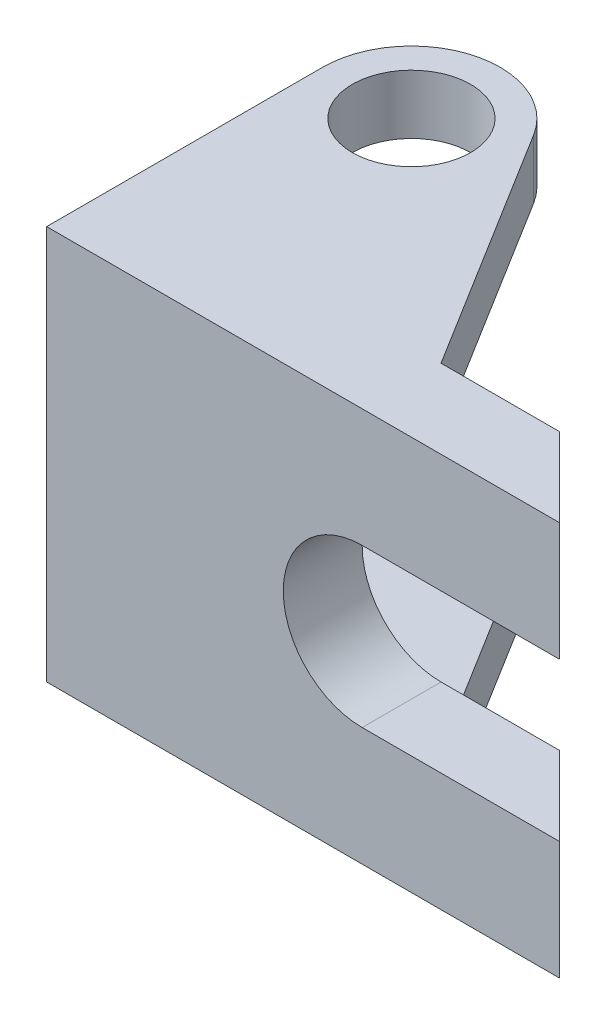
ISO-10303-21;
HEADER;
FILE_DESCRIPTION(('STEP AP214'),'2;1');
FILE_NAME('part.step','',(''),(''),'','','');
FILE_SCHEMA(('AUTOMOTIVE_DESIGN { 1 0 10303 214 1 1 1 1 }'));
ENDSEC;
DATA;
#1=APPLICATION_CONTEXT('core data for automotive mechanical design processes');
#2=APPLICATION_PROTOCOL_DEFINITION('international standard','automotive_design',2000,#1);
#3=PRODUCT_CONTEXT('',#1,'mechanical');
#4=PRODUCT('Part','Part','',(#3));
#5=PRODUCT_RELATED_PRODUCT_CATEGORY('part','',(#4));
#6=PRODUCT_DEFINITION_FORMATION('','',#4);
#7=PRODUCT_DEFINITION_CONTEXT('part definition',#1,'design');
#8=PRODUCT_DEFINITION('design','',#6,#7);
#9=PRODUCT_DEFINITION_SHAPE('','',#8);
#10=(LENGTH_UNIT() NAMED_UNIT(*) SI_UNIT(.MILLI.,.METRE.));
#11=(NAMED_UNIT(*) PLANE_ANGLE_UNIT() SI_UNIT($,.RADIAN.));
#12=(NAMED_UNIT(*) SI_UNIT($,.STERADIAN.) SOLID_ANGLE_UNIT());
#13=UNCERTAINTY_MEASURE_WITH_UNIT(LENGTH_MEASURE(1.E-05),#10,'distance_accuracy_value','');
#14=(GEOMETRIC_REPRESENTATION_CONTEXT(3) GLOBAL_UNCERTAINTY_ASSIGNED_CONTEXT((#13)) GLOBAL_UNIT_ASSIGNED_CONTEXT((#10,
#11,#12)) REPRESENTATION_CONTEXT('',''));
#15=CARTESIAN_POINT('',(0.,0.,0.));
#16=DIRECTION('',(0.,0.,1.));
#17=DIRECTION('',(1.,0.,0.));
#18=AXIS2_PLACEMENT_3D('',#15,#16,#17);
#19=CARTESIAN_POINT('',(0.,100.,35.));
#20=DIRECTION('',(0.,0.,1.));
#21=DIRECTION('',(1.,0.,0.));
#22=AXIS2_PLACEMENT_3D('',#19,#20,#21);
#23=PLANE('',#22);
#24=CARTESIAN_POINT('',(15.,50.,35.));
#25=DIRECTION('',(0.,0.,-1.));
#26=DIRECTION('',(-1.,0.,0.));
#27=AXIS2_PLACEMENT_3D('',#24,#25,#26);
#28=CIRCLE('',#27,20.);
#29=CARTESIAN_POINT('',(15.,30.,35.));
#30=VERTEX_POINT('',#29);
#31=CARTESIAN_POINT('',(15.,70.,35.));
#32=VERTEX_POINT('',#31);
#33=EDGE_CURVE('E203',#30,#32,#28,.T.);
#34=ORIENTED_EDGE('',*,*,#33,.T.);
#35=DIRECTION('',(-1.,0.,0.));
#36=VECTOR('',#35,1.);
#37=CARTESIAN_POINT('',(0.,70.,35.));
#38=LINE('',#37,#36);
#39=CARTESIAN_POINT('',(65.,70.,35.));
#40=VERTEX_POINT('',#39);
#41=EDGE_CURVE('E217',#40,#32,#38,.T.);
#42=ORIENTED_EDGE('',*,*,#41,.F.);
#43=DIRECTION('',(0.,-1.,0.));
#44=VECTOR('',#43,1.);
#45=CARTESIAN_POINT('',(65.,100.,35.));
#46=LINE('',#45,#44);
#47=CARTESIAN_POINT('',(65.,100.,35.));
#48=VERTEX_POINT('',#47);
#49=EDGE_CURVE('E338',#48,#40,#46,.T.);
#50=ORIENTED_EDGE('',*,*,#49,.F.);
#51=DIRECTION('',(-1.,0.,0.));
#52=VECTOR('',#51,1.);
#53=CARTESIAN_POINT('',(0.,100.,35.));
#54=LINE('',#53,#52);
#55=CARTESIAN_POINT('',(-65.,100.,35.));
#56=VERTEX_POINT('',#55);
#57=EDGE_CURVE('E279',#48,#56,#54,.T.);
#58=ORIENTED_EDGE('',*,*,#57,.T.);
#59=DIRECTION('',(0.,-1.,0.));
#60=VECTOR('',#59,1.);
#61=CARTESIAN_POINT('',(-65.,100.,35.));
#62=LINE('',#61,#60);
#63=CARTESIAN_POINT('',(-65.,0.,35.));
#64=VERTEX_POINT('',#63);
#65=EDGE_CURVE('E342',#56,#64,#62,.T.);
#66=ORIENTED_EDGE('',*,*,#65,.T.);
#67=DIRECTION('',(-1.,0.,0.));
#68=VECTOR('',#67,1.);
#69=CARTESIAN_POINT('',(0.,0.,35.));
#70=LINE('',#69,#68);
#71=CARTESIAN_POINT('',(65.,0.,35.));
#72=VERTEX_POINT('',#71);
#73=EDGE_CURVE('E305',#72,#64,#70,.T.);
#74=ORIENTED_EDGE('',*,*,#73,.F.);
#75=CARTESIAN_POINT('',(65.,30.,35.));
#76=VERTEX_POINT('',#75);
#77=EDGE_CURVE('E215',#76,#72,#46,.T.);
#78=ORIENTED_EDGE('',*,*,#77,.F.);
#79=DIRECTION('',(-1.,0.,0.));
#80=VECTOR('',#79,1.);
#81=CARTESIAN_POINT('',(0.,30.,35.));
#82=LINE('',#81,#80);
#83=EDGE_CURVE('E197',#76,#30,#82,.T.);
#84=ORIENTED_EDGE('',*,*,#83,.T.);
#85=EDGE_LOOP('',(#34,#42,#50,#58,#66,#74,#78,#84));
#86=FACE_BOUND('',#85,.T.);
#87=ADVANCED_FACE('F93',(#86),#23,.T.);
#88=CARTESIAN_POINT('',(15.,100.,-15.));
#89=DIRECTION('',(-0.707106781186547,0.,0.707106781186548));
#90=DIRECTION('',(0.707106781186548,0.,0.707106781186547));
#91=AXIS2_PLACEMENT_3D('',#88,#89,#90);
#92=PLANE('',#91);
#93=DIRECTION('',(0.707106781186548,0.,0.707106781186547));
#94=VECTOR('',#93,1.);
#95=CARTESIAN_POINT('',(15.,70.,-15.));
#96=LINE('',#95,#94);
#97=CARTESIAN_POINT('',(45.,70.,15.));
#98=VERTEX_POINT('',#97);
#99=EDGE_CURVE('E231',#98,#40,#96,.T.);
#100=ORIENTED_EDGE('',*,*,#99,.F.);
#101=DIRECTION('',(0.,-1.,0.));
#102=VECTOR('',#101,1.);
#103=CARTESIAN_POINT('',(45.,100.,15.));
#104=LINE('',#103,#102);
#105=CARTESIAN_POINT('',(45.,100.,15.));
#106=VERTEX_POINT('',#105);
#107=EDGE_CURVE('E334',#106,#98,#104,.T.);
#108=ORIENTED_EDGE('',*,*,#107,.F.);
#109=DIRECTION('',(-0.707106781186548,0.,-0.707106781186547));
#110=VECTOR('',#109,1.);
#111=CARTESIAN_POINT('',(15.,100.,-15.));
#112=LINE('',#111,#110);
#113=EDGE_CURVE('E283',#48,#106,#112,.T.);
#114=ORIENTED_EDGE('',*,*,#113,.F.);
#115=ORIENTED_EDGE('',*,*,#49,.T.);
#116=EDGE_LOOP('',(#100,#108,#114,#115));
#117=FACE_BOUND('',#116,.T.);
#118=ADVANCED_FACE('F399',(#117),#92,.F.);
#119=CARTESIAN_POINT('',(0.,100.,15.));
#120=DIRECTION('',(0.,0.,1.));
#121=DIRECTION('',(1.,0.,0.));
#122=AXIS2_PLACEMENT_3D('',#119,#120,#121);
#123=PLANE('',#122);
#124=DIRECTION('',(1.,0.,0.));
#125=VECTOR('',#124,1.);
#126=CARTESIAN_POINT('',(0.,70.,15.));
#127=LINE('',#126,#125);
#128=CARTESIAN_POINT('',(15.,70.,15.));
#129=VERTEX_POINT('',#128);
#130=EDGE_CURVE('E228',#129,#98,#127,.T.);
#131=ORIENTED_EDGE('',*,*,#130,.F.);
#132=CARTESIAN_POINT('',(15.,50.,15.));
#133=DIRECTION('',(0.,0.,-1.));
#134=DIRECTION('',(-1.,0.,0.));
#135=AXIS2_PLACEMENT_3D('',#132,#133,#134);
#136=CIRCLE('',#135,20.);
#137=CARTESIAN_POINT('',(15.,30.,15.));
#138=VERTEX_POINT('',#137);
#139=EDGE_CURVE('E236',#138,#129,#136,.T.);
#140=ORIENTED_EDGE('',*,*,#139,.F.);
#141=DIRECTION('',(1.,0.,0.));
#142=VECTOR('',#141,1.);
#143=CARTESIAN_POINT('',(0.,30.,15.));
#144=LINE('',#143,#142);
#145=CARTESIAN_POINT('',(45.,30.,15.));
#146=VERTEX_POINT('',#145);
#147=EDGE_CURVE('E198',#138,#146,#144,.T.);
#148=ORIENTED_EDGE('',*,*,#147,.T.);
#149=CARTESIAN_POINT('',(45.,0.,15.));
#150=VERTEX_POINT('',#149);
#151=EDGE_CURVE('E333',#146,#150,#104,.T.);
#152=ORIENTED_EDGE('',*,*,#151,.T.);
#153=DIRECTION('',(-1.,0.,0.));
#154=VECTOR('',#153,1.);
#155=CARTESIAN_POINT('',(0.,0.,15.));
#156=LINE('',#155,#154);
#157=CARTESIAN_POINT('',(15.,0.,15.));
#158=VERTEX_POINT('',#157);
#159=EDGE_CURVE('E313',#150,#158,#156,.T.);
#160=ORIENTED_EDGE('',*,*,#159,.T.);
#161=DIRECTION('',(0.,-1.,0.));
#162=VECTOR('',#161,1.);
#163=CARTESIAN_POINT('',(15.,100.,15.));
#164=LINE('',#163,#162);
#165=CARTESIAN_POINT('',(15.,15.,15.));
#166=VERTEX_POINT('',#165);
#167=EDGE_CURVE('E328',#166,#158,#164,.T.);
#168=ORIENTED_EDGE('',*,*,#167,.F.);
#169=DIRECTION('',(-1.,0.,0.));
#170=VECTOR('',#169,1.);
#171=CARTESIAN_POINT('',(0.,15.,15.));
#172=LINE('',#171,#170);
#173=CARTESIAN_POINT('',(-65.,15.,15.));
#174=VERTEX_POINT('',#173);
#175=EDGE_CURVE('E239',#166,#174,#172,.T.);
#176=ORIENTED_EDGE('',*,*,#175,.T.);
#177=DIRECTION('',(0.,-1.,0.));
#178=VECTOR('',#177,1.);
#179=CARTESIAN_POINT('',(-65.,100.,15.));
#180=LINE('',#179,#178);
#181=CARTESIAN_POINT('',(-65.,85.,15.));
#182=VERTEX_POINT('',#181);
#183=EDGE_CURVE('E243',#182,#174,#180,.T.);
#184=ORIENTED_EDGE('',*,*,#183,.F.);
#185=DIRECTION('',(-1.,0.,0.));
#186=VECTOR('',#185,1.);
#187=CARTESIAN_POINT('',(0.,85.,15.));
#188=LINE('',#187,#186);
#189=CARTESIAN_POINT('',(15.,85.,15.));
#190=VERTEX_POINT('',#189);
#191=EDGE_CURVE('E117',#190,#182,#188,.T.);
#192=ORIENTED_EDGE('',*,*,#191,.F.);
#193=CARTESIAN_POINT('',(15.,100.,15.));
#194=VERTEX_POINT('',#193);
#195=EDGE_CURVE('E329',#194,#190,#164,.T.);
#196=ORIENTED_EDGE('',*,*,#195,.F.);
#197=DIRECTION('',(-1.,0.,0.));
#198=VECTOR('',#197,1.);
#199=CARTESIAN_POINT('',(0.,100.,15.));
#200=LINE('',#199,#198);
#201=EDGE_CURVE('E286',#106,#194,#200,.T.);
#202=ORIENTED_EDGE('',*,*,#201,.F.);
#203=ORIENTED_EDGE('',*,*,#107,.T.);
#204=EDGE_LOOP('',(#131,#140,#148,#152,#160,#168,#176,#184,#192,#196,#202,#203));
#205=FACE_BOUND('',#204,.T.);
#206=ADVANCED_FACE('F359',(#205),#123,.F.);
#207=CARTESIAN_POINT('',(-42.5,100.,-35.));
#208=DIRECTION('',(0.,-1.,0.));
#209=DIRECTION('',(0.,0.,-1.));
#210=AXIS2_PLACEMENT_3D('',#207,#208,#209);
#211=CYLINDRICAL_SURFACE('',#210,15.);
#212=CARTESIAN_POINT('',(-42.5,0.,-35.));
#213=DIRECTION('',(0.,1.,0.));
#214=DIRECTION('',(0.,0.,1.));
#215=AXIS2_PLACEMENT_3D('',#212,#213,#214);
#216=CIRCLE('',#215,15.);
#217=CARTESIAN_POINT('',(-42.5,0.,-20.));
#218=VERTEX_POINT('',#217);
#219=EDGE_CURVE('E275',#218,#218,#216,.T.);
#220=ORIENTED_EDGE('',*,*,#219,.F.);
#221=EDGE_LOOP('',(#220));
#222=FACE_BOUND('',#221,.T.);
#223=CARTESIAN_POINT('',(-42.5,15.,-35.));
#224=DIRECTION('',(0.,1.,0.));
#225=DIRECTION('',(0.,0.,1.));
#226=AXIS2_PLACEMENT_3D('',#223,#224,#225);
#227=CIRCLE('',#226,15.);
#228=CARTESIAN_POINT('',(-42.5,15.,-20.));
#229=VERTEX_POINT('',#228);
#230=EDGE_CURVE('E254',#229,#229,#227,.T.);
#231=ORIENTED_EDGE('',*,*,#230,.T.);
#232=EDGE_LOOP('',(#231));
#233=FACE_BOUND('',#232,.T.);
#234=ADVANCED_FACE('F429',(#222,#233),#211,.F.);
#235=CARTESIAN_POINT('',(-42.5,100.,-35.));
#236=DIRECTION('',(0.,-1.,0.));
#237=DIRECTION('',(0.,0.,-1.));
#238=AXIS2_PLACEMENT_3D('',#235,#236,#237);
#239=CYLINDRICAL_SURFACE('',#238,22.5);
#240=CARTESIAN_POINT('',(-42.5,15.,-35.));
#241=DIRECTION('',(0.,1.,0.));
#242=DIRECTION('',(0.,0.,1.));
#243=AXIS2_PLACEMENT_3D('',#240,#241,#242);
#244=CIRCLE('',#243,22.5);
#245=CARTESIAN_POINT('',(-23.3808419798655,15.,-46.8620317231547));
#246=VERTEX_POINT('',#245);
#247=CARTESIAN_POINT('',(-65.,15.,-35.));
#248=VERTEX_POINT('',#247);
#249=EDGE_CURVE('E247',#246,#248,#244,.T.);
#250=ORIENTED_EDGE('',*,*,#249,.F.);
#251=DIRECTION('',(0.,-1.,0.));
#252=VECTOR('',#251,1.);
#253=CARTESIAN_POINT('',(-23.3808419798655,100.,-46.8620317231547));
#254=LINE('',#253,#252);
#255=CARTESIAN_POINT('',(-23.3808419798655,0.,-46.8620317231547));
#256=VERTEX_POINT('',#255);
#257=EDGE_CURVE('E297',#246,#256,#254,.T.);
#258=ORIENTED_EDGE('',*,*,#257,.T.);
#259=CARTESIAN_POINT('',(-42.5,0.,-35.));
#260=DIRECTION('',(0.,1.,0.));
#261=DIRECTION('',(0.,0.,1.));
#262=AXIS2_PLACEMENT_3D('',#259,#260,#261);
#263=CIRCLE('',#262,22.5);
#264=CARTESIAN_POINT('',(-65.,0.,-35.));
#265=VERTEX_POINT('',#264);
#266=EDGE_CURVE('E269',#256,#265,#263,.T.);
#267=ORIENTED_EDGE('',*,*,#266,.T.);
#268=DIRECTION('',(0.,-1.,0.));
#269=VECTOR('',#268,1.);
#270=CARTESIAN_POINT('',(-65.,100.,-35.));
#271=LINE('',#270,#269);
#272=EDGE_CURVE('E345',#248,#265,#271,.T.);
#273=ORIENTED_EDGE('',*,*,#272,.F.);
#274=EDGE_LOOP('',(#250,#258,#267,#273));
#275=FACE_BOUND('',#274,.T.);
#276=ADVANCED_FACE('F366',(#275),#239,.T.);
#277=CARTESIAN_POINT('',(4.11111539093425,100.,-2.55064481048043));
#278=DIRECTION('',(0.849740356450421,0.,-0.527201409917984));
#279=DIRECTION('',(-0.527201409917984,0.,-0.849740356450421));
#280=AXIS2_PLACEMENT_3D('',#277,#278,#279);
#281=PLANE('',#280);
#282=DIRECTION('',(0.527201409917984,0.,0.849740356450421));
#283=VECTOR('',#282,1.);
#284=CARTESIAN_POINT('',(4.11111539093425,85.,-2.55064481048043));
#285=LINE('',#284,#283);
#286=CARTESIAN_POINT('',(-23.3808419798655,85.,-46.8620317231547));
#287=VERTEX_POINT('',#286);
#288=EDGE_CURVE('E12',#287,#190,#285,.T.);
#289=ORIENTED_EDGE('',*,*,#288,.F.);
#290=CARTESIAN_POINT('',(-23.3808419798655,100.,-46.8620317231547));
#291=VERTEX_POINT('',#290);
#292=EDGE_CURVE('E324',#291,#287,#254,.T.);
#293=ORIENTED_EDGE('',*,*,#292,.F.);
#294=DIRECTION('',(0.527201409917984,0.,0.849740356450421));
#295=VECTOR('',#294,1.);
#296=CARTESIAN_POINT('',(4.11111539093425,100.,-2.55064481048043));
#297=LINE('',#296,#295);
#298=EDGE_CURVE('E289',#291,#194,#297,.T.);
#299=ORIENTED_EDGE('',*,*,#298,.T.);
#300=ORIENTED_EDGE('',*,*,#195,.T.);
#301=EDGE_LOOP('',(#289,#293,#299,#300));
#302=FACE_BOUND('',#301,.T.);
#303=ADVANCED_FACE('F395',(#302),#281,.T.);
#304=ORIENTED_EDGE('',*,*,#257,.F.);
#305=DIRECTION('',(0.527201409917984,0.,0.849740356450421));
#306=VECTOR('',#305,1.);
#307=CARTESIAN_POINT('',(4.11111539093425,15.,-2.55064481048043));
#308=LINE('',#307,#306);
#309=EDGE_CURVE('E102',#246,#166,#308,.T.);
#310=ORIENTED_EDGE('',*,*,#309,.T.);
#311=ORIENTED_EDGE('',*,*,#167,.T.);
#312=DIRECTION('',(0.527201409917984,0.,0.849740356450421));
#313=VECTOR('',#312,1.);
#314=CARTESIAN_POINT('',(4.11111539093425,0.,-2.55064481048043));
#315=LINE('',#314,#313);
#316=EDGE_CURVE('E317',#256,#158,#315,.T.);
#317=ORIENTED_EDGE('',*,*,#316,.F.);
#318=EDGE_LOOP('',(#304,#310,#311,#317));
#319=FACE_BOUND('',#318,.T.);
#320=ADVANCED_FACE('F355',(#319),#281,.T.);
#321=CARTESIAN_POINT('',(-42.5,85.,-35.));
#322=DIRECTION('',(0.,1.,0.));
#323=DIRECTION('',(0.,0.,1.));
#324=AXIS2_PLACEMENT_3D('',#321,#322,#323);
#325=CIRCLE('',#324,15.);
#326=CARTESIAN_POINT('',(-42.5,85.,-20.));
#327=VERTEX_POINT('',#326);
#328=EDGE_CURVE('E265',#327,#327,#325,.T.);
#329=ORIENTED_EDGE('',*,*,#328,.F.);
#330=EDGE_LOOP('',(#329));
#331=FACE_BOUND('',#330,.T.);
#332=CARTESIAN_POINT('',(-42.5,100.,-35.));
#333=DIRECTION('',(0.,1.,0.));
#334=DIRECTION('',(0.,0.,1.));
#335=AXIS2_PLACEMENT_3D('',#332,#333,#334);
#336=CIRCLE('',#335,15.);
#337=CARTESIAN_POINT('',(-42.5,100.,-20.));
#338=VERTEX_POINT('',#337);
#339=EDGE_CURVE('E293',#338,#338,#336,.T.);
#340=ORIENTED_EDGE('',*,*,#339,.T.);
#341=EDGE_LOOP('',(#340));
#342=FACE_BOUND('',#341,.T.);
#343=ADVANCED_FACE('F420',(#331,#342),#211,.F.);
#344=CARTESIAN_POINT('',(0.,0.,0.));
#345=DIRECTION('',(0.,1.,0.));
#346=DIRECTION('',(0.,0.,1.));
#347=AXIS2_PLACEMENT_3D('',#344,#345,#346);
#348=PLANE('',#347);
#349=ORIENTED_EDGE('',*,*,#266,.F.);
#350=ORIENTED_EDGE('',*,*,#316,.T.);
#351=ORIENTED_EDGE('',*,*,#159,.F.);
#352=DIRECTION('',(-0.707106781186548,0.,-0.707106781186547));
#353=VECTOR('',#352,1.);
#354=CARTESIAN_POINT('',(15.,0.,-15.));
#355=LINE('',#354,#353);
#356=EDGE_CURVE('E309',#72,#150,#355,.T.);
#357=ORIENTED_EDGE('',*,*,#356,.F.);
#358=ORIENTED_EDGE('',*,*,#73,.T.);
#359=DIRECTION('',(0.,0.,-1.));
#360=VECTOR('',#359,1.);
#361=CARTESIAN_POINT('',(-65.,0.,0.));
#362=LINE('',#361,#360);
#363=EDGE_CURVE('E301',#64,#265,#362,.T.);
#364=ORIENTED_EDGE('',*,*,#363,.T.);
#365=EDGE_LOOP('',(#349,#350,#351,#357,#358,#364));
#366=FACE_BOUND('',#365,.T.);
#367=ORIENTED_EDGE('',*,*,#219,.T.);
#368=EDGE_LOOP('',(#367));
#369=FACE_BOUND('',#368,.T.);
#370=ADVANCED_FACE('F369',(#366,#369),#348,.F.);
#371=CARTESIAN_POINT('',(-42.5,85.,-35.));
#372=DIRECTION('',(0.,1.,0.));
#373=DIRECTION('',(0.,0.,1.));
#374=AXIS2_PLACEMENT_3D('',#371,#372,#373);
#375=CIRCLE('',#374,22.5);
#376=CARTESIAN_POINT('',(-65.,85.,-35.));
#377=VERTEX_POINT('',#376);
#378=EDGE_CURVE('E258',#287,#377,#375,.T.);
#379=ORIENTED_EDGE('',*,*,#378,.T.);
#380=CARTESIAN_POINT('',(-65.,100.,-35.));
#381=VERTEX_POINT('',#380);
#382=EDGE_CURVE('E346',#381,#377,#271,.T.);
#383=ORIENTED_EDGE('',*,*,#382,.F.);
#384=CARTESIAN_POINT('',(-42.5,100.,-35.));
#385=DIRECTION('',(0.,1.,0.));
#386=DIRECTION('',(0.,0.,1.));
#387=AXIS2_PLACEMENT_3D('',#384,#385,#386);
#388=CIRCLE('',#387,22.5);
#389=EDGE_CURVE('E270',#291,#381,#388,.T.);
#390=ORIENTED_EDGE('',*,*,#389,.F.);
#391=ORIENTED_EDGE('',*,*,#292,.T.);
#392=EDGE_LOOP('',(#379,#383,#390,#391));
#393=FACE_BOUND('',#392,.T.);
#394=ADVANCED_FACE('F95',(#393),#239,.T.);
#395=CARTESIAN_POINT('',(0.,100.,0.));
#396=DIRECTION('',(0.,1.,0.));
#397=DIRECTION('',(0.,0.,1.));
#398=AXIS2_PLACEMENT_3D('',#395,#396,#397);
#399=PLANE('',#398);
#400=ORIENTED_EDGE('',*,*,#389,.T.);
#401=DIRECTION('',(0.,0.,-1.));
#402=VECTOR('',#401,1.);
#403=CARTESIAN_POINT('',(-65.,100.,0.));
#404=LINE('',#403,#402);
#405=EDGE_CURVE('E274',#56,#381,#404,.T.);
#406=ORIENTED_EDGE('',*,*,#405,.F.);
#407=ORIENTED_EDGE('',*,*,#57,.F.);
#408=ORIENTED_EDGE('',*,*,#113,.T.);
#409=ORIENTED_EDGE('',*,*,#201,.T.);
#410=ORIENTED_EDGE('',*,*,#298,.F.);
#411=EDGE_LOOP('',(#400,#406,#407,#408,#409,#410));
#412=FACE_BOUND('',#411,.T.);
#413=ORIENTED_EDGE('',*,*,#339,.F.);
#414=EDGE_LOOP('',(#413));
#415=FACE_BOUND('',#414,.T.);
#416=ADVANCED_FACE('F385',(#412,#415),#399,.T.);
#417=CARTESIAN_POINT('',(-65.,100.,0.));
#418=DIRECTION('',(-1.,0.,0.));
#419=DIRECTION('',(0.,0.,1.));
#420=AXIS2_PLACEMENT_3D('',#417,#418,#419);
#421=PLANE('',#420);
#422=DIRECTION('',(0.,0.,-1.));
#423=VECTOR('',#422,1.);
#424=CARTESIAN_POINT('',(-65.,85.,0.));
#425=LINE('',#424,#423);
#426=EDGE_CURVE('E261',#182,#377,#425,.T.);
#427=ORIENTED_EDGE('',*,*,#426,.F.);
#428=ORIENTED_EDGE('',*,*,#183,.T.);
#429=DIRECTION('',(0.,0.,-1.));
#430=VECTOR('',#429,1.);
#431=CARTESIAN_POINT('',(-65.,15.,0.));
#432=LINE('',#431,#430);
#433=EDGE_CURVE('E250',#174,#248,#432,.T.);
#434=ORIENTED_EDGE('',*,*,#433,.T.);
#435=ORIENTED_EDGE('',*,*,#272,.T.);
#436=ORIENTED_EDGE('',*,*,#363,.F.);
#437=ORIENTED_EDGE('',*,*,#65,.F.);
#438=ORIENTED_EDGE('',*,*,#405,.T.);
#439=ORIENTED_EDGE('',*,*,#382,.T.);
#440=EDGE_LOOP('',(#427,#428,#434,#435,#436,#437,#438,#439));
#441=FACE_BOUND('',#440,.T.);
#442=ADVANCED_FACE('F375',(#441),#421,.T.);
#443=ORIENTED_EDGE('',*,*,#151,.F.);
#444=DIRECTION('',(0.707106781186548,0.,0.707106781186547));
#445=VECTOR('',#444,1.);
#446=CARTESIAN_POINT('',(15.,30.,-15.));
#447=LINE('',#446,#445);
#448=EDGE_CURVE('E109',#146,#76,#447,.T.);
#449=ORIENTED_EDGE('',*,*,#448,.T.);
#450=ORIENTED_EDGE('',*,*,#77,.T.);
#451=ORIENTED_EDGE('',*,*,#356,.T.);
#452=EDGE_LOOP('',(#443,#449,#450,#451));
#453=FACE_BOUND('',#452,.T.);
#454=ADVANCED_FACE('F381',(#453),#92,.F.);
#455=CARTESIAN_POINT('',(0.,85.,-57.5));
#456=DIRECTION('',(0.,1.,0.));
#457=DIRECTION('',(0.,0.,1.));
#458=AXIS2_PLACEMENT_3D('',#455,#456,#457);
#459=PLANE('',#458);
#460=ORIENTED_EDGE('',*,*,#328,.T.);
#461=EDGE_LOOP('',(#460));
#462=FACE_BOUND('',#461,.T.);
#463=ORIENTED_EDGE('',*,*,#426,.T.);
#464=ORIENTED_EDGE('',*,*,#378,.F.);
#465=ORIENTED_EDGE('',*,*,#288,.T.);
#466=ORIENTED_EDGE('',*,*,#191,.T.);
#467=EDGE_LOOP('',(#463,#464,#465,#466));
#468=FACE_BOUND('',#467,.T.);
#469=ADVANCED_FACE('F393',(#462,#468),#459,.F.);
#470=CARTESIAN_POINT('',(0.,15.,-57.5));
#471=DIRECTION('',(0.,1.,0.));
#472=DIRECTION('',(0.,0.,1.));
#473=AXIS2_PLACEMENT_3D('',#470,#471,#472);
#474=PLANE('',#473);
#475=ORIENTED_EDGE('',*,*,#230,.F.);
#476=EDGE_LOOP('',(#475));
#477=FACE_BOUND('',#476,.T.);
#478=ORIENTED_EDGE('',*,*,#175,.F.);
#479=ORIENTED_EDGE('',*,*,#309,.F.);
#480=ORIENTED_EDGE('',*,*,#249,.T.);
#481=ORIENTED_EDGE('',*,*,#433,.F.);
#482=EDGE_LOOP('',(#478,#479,#480,#481));
#483=FACE_BOUND('',#482,.T.);
#484=ADVANCED_FACE('F409',(#477,#483),#474,.T.);
#485=CARTESIAN_POINT('',(15.,50.,35.));
#486=DIRECTION('',(0.,0.,-1.));
#487=DIRECTION('',(-1.,0.,0.));
#488=AXIS2_PLACEMENT_3D('',#485,#486,#487);
#489=CYLINDRICAL_SURFACE('',#488,20.);
#490=DIRECTION('',(0.,0.,-1.));
#491=VECTOR('',#490,1.);
#492=CARTESIAN_POINT('',(15.,70.,35.));
#493=LINE('',#492,#491);
#494=EDGE_CURVE('E202',#32,#129,#493,.T.);
#495=ORIENTED_EDGE('',*,*,#494,.F.);
#496=ORIENTED_EDGE('',*,*,#33,.F.);
#497=DIRECTION('',(0.,0.,-1.));
#498=VECTOR('',#497,1.);
#499=CARTESIAN_POINT('',(15.,30.,35.));
#500=LINE('',#499,#498);
#501=EDGE_CURVE('E193',#30,#138,#500,.T.);
#502=ORIENTED_EDGE('',*,*,#501,.T.);
#503=ORIENTED_EDGE('',*,*,#139,.T.);
#504=EDGE_LOOP('',(#495,#496,#502,#503));
#505=FACE_BOUND('',#504,.T.);
#506=ADVANCED_FACE('F207',(#505),#489,.F.);
#507=CARTESIAN_POINT('',(0.,70.,35.));
#508=DIRECTION('',(0.,-1.,0.));
#509=DIRECTION('',(1.,0.,0.));
#510=AXIS2_PLACEMENT_3D('',#507,#508,#509);
#511=PLANE('',#510);
#512=ORIENTED_EDGE('',*,*,#99,.T.);
#513=ORIENTED_EDGE('',*,*,#41,.T.);
#514=ORIENTED_EDGE('',*,*,#494,.T.);
#515=ORIENTED_EDGE('',*,*,#130,.T.);
#516=EDGE_LOOP('',(#512,#513,#514,#515));
#517=FACE_BOUND('',#516,.T.);
#518=ADVANCED_FACE('F401',(#517),#511,.T.);
#519=CARTESIAN_POINT('',(0.,30.,35.));
#520=DIRECTION('',(0.,-1.,0.));
#521=DIRECTION('',(1.,0.,0.));
#522=AXIS2_PLACEMENT_3D('',#519,#520,#521);
#523=PLANE('',#522);
#524=ORIENTED_EDGE('',*,*,#147,.F.);
#525=ORIENTED_EDGE('',*,*,#501,.F.);
#526=ORIENTED_EDGE('',*,*,#83,.F.);
#527=ORIENTED_EDGE('',*,*,#448,.F.);
#528=EDGE_LOOP('',(#524,#525,#526,#527));
#529=FACE_BOUND('',#528,.T.);
#530=ADVANCED_FACE('F195',(#529),#523,.F.);
#531=CLOSED_SHELL('',(#87,#118,#206,#234,#276,#303,#320,#343,#370,#394,#416,#442,#454,#469,#484,
#506,#518,#530));
#532=MANIFOLD_SOLID_BREP('B2',#531);
#533=ADVANCED_BREP_SHAPE_REPRESENTATION('',(#18,#532),#14);
#534=SHAPE_DEFINITION_REPRESENTATION(#9,#533);
ENDSEC;
END-ISO-10303-21;
